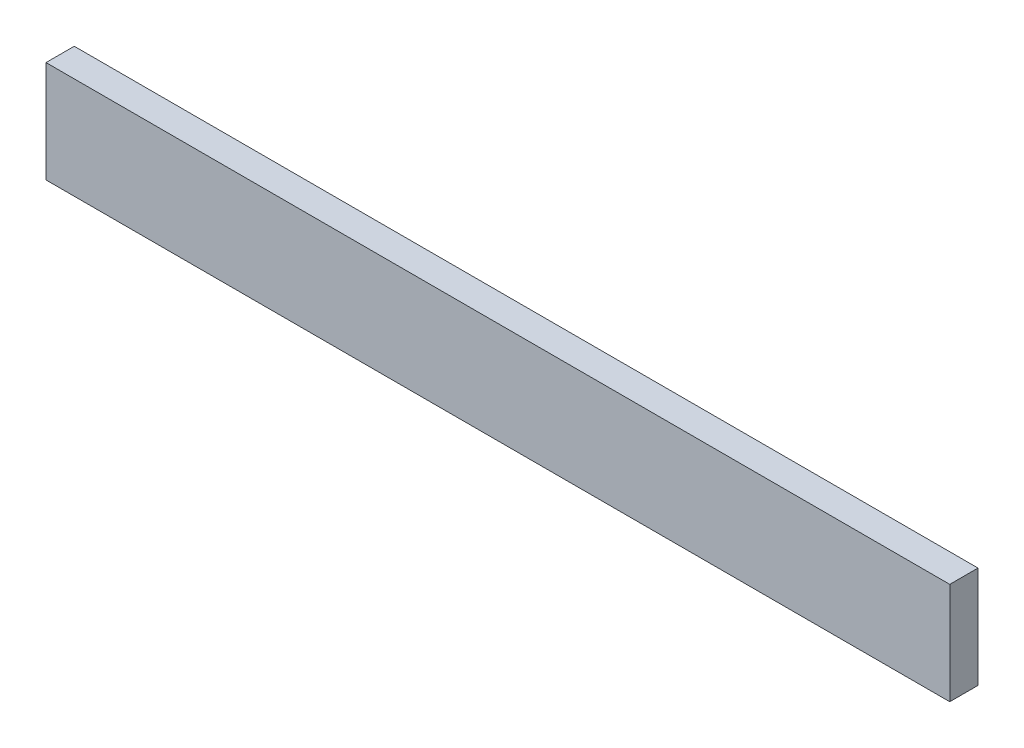
ISO-10303-21;
HEADER;
FILE_DESCRIPTION(('STEP AP214'),'2;1');
FILE_NAME('part.step','',(''),(''),'','','');
FILE_SCHEMA(('AUTOMOTIVE_DESIGN { 1 0 10303 214 1 1 1 1 }'));
ENDSEC;
DATA;
#1=APPLICATION_CONTEXT('core data for automotive mechanical design processes');
#2=APPLICATION_PROTOCOL_DEFINITION('international standard','automotive_design',2000,#1);
#3=PRODUCT_CONTEXT('',#1,'mechanical');
#4=PRODUCT('Part','Part','',(#3));
#5=PRODUCT_RELATED_PRODUCT_CATEGORY('part','',(#4));
#6=PRODUCT_DEFINITION_FORMATION('','',#4);
#7=PRODUCT_DEFINITION_CONTEXT('part definition',#1,'design');
#8=PRODUCT_DEFINITION('design','',#6,#7);
#9=PRODUCT_DEFINITION_SHAPE('','',#8);
#10=(LENGTH_UNIT() NAMED_UNIT(*) SI_UNIT(.MILLI.,.METRE.));
#11=(NAMED_UNIT(*) PLANE_ANGLE_UNIT() SI_UNIT($,.RADIAN.));
#12=(NAMED_UNIT(*) SI_UNIT($,.STERADIAN.) SOLID_ANGLE_UNIT());
#13=UNCERTAINTY_MEASURE_WITH_UNIT(LENGTH_MEASURE(1.E-05),#10,'distance_accuracy_value','');
#14=(GEOMETRIC_REPRESENTATION_CONTEXT(3) GLOBAL_UNCERTAINTY_ASSIGNED_CONTEXT((#13)) GLOBAL_UNIT_ASSIGNED_CONTEXT((#10,
#11,#12)) REPRESENTATION_CONTEXT('',''));
#15=CARTESIAN_POINT('',(0.,0.,0.));
#16=DIRECTION('',(0.,0.,1.));
#17=DIRECTION('',(1.,0.,0.));
#18=AXIS2_PLACEMENT_3D('',#15,#16,#17);
#19=CARTESIAN_POINT('',(0.,0.,25.));
#20=DIRECTION('',(1.,0.,0.));
#21=DIRECTION('',(0.,0.,-1.));
#22=AXIS2_PLACEMENT_3D('',#19,#20,#21);
#23=PLANE('',#22);
#24=DIRECTION('',(0.,-1.,0.));
#25=VECTOR('',#24,1.);
#26=CARTESIAN_POINT('',(0.,0.,0.));
#27=LINE('',#26,#25);
#28=CARTESIAN_POINT('',(0.,90.,0.));
#29=VERTEX_POINT('',#28);
#30=CARTESIAN_POINT('',(0.,0.,0.));
#31=VERTEX_POINT('',#30);
#32=EDGE_CURVE('E111',#29,#31,#27,.T.);
#33=ORIENTED_EDGE('',*,*,#32,.T.);
#34=DIRECTION('',(0.,0.,-1.));
#35=VECTOR('',#34,1.);
#36=CARTESIAN_POINT('',(0.,0.,25.));
#37=LINE('',#36,#35);
#38=CARTESIAN_POINT('',(0.,0.,25.));
#39=VERTEX_POINT('',#38);
#40=EDGE_CURVE('E11',#39,#31,#37,.T.);
#41=ORIENTED_EDGE('',*,*,#40,.F.);
#42=DIRECTION('',(0.,-1.,0.));
#43=VECTOR('',#42,1.);
#44=CARTESIAN_POINT('',(0.,0.,25.));
#45=LINE('',#44,#43);
#46=CARTESIAN_POINT('',(0.,90.,25.));
#47=VERTEX_POINT('',#46);
#48=EDGE_CURVE('E95',#47,#39,#45,.T.);
#49=ORIENTED_EDGE('',*,*,#48,.F.);
#50=DIRECTION('',(0.,0.,-1.));
#51=VECTOR('',#50,1.);
#52=CARTESIAN_POINT('',(0.,90.,25.));
#53=LINE('',#52,#51);
#54=EDGE_CURVE('E107',#47,#29,#53,.T.);
#55=ORIENTED_EDGE('',*,*,#54,.T.);
#56=EDGE_LOOP('',(#33,#41,#49,#55));
#57=FACE_BOUND('',#56,.T.);
#58=ADVANCED_FACE('F43',(#57),#23,.F.);
#59=CARTESIAN_POINT('',(0.,0.,25.));
#60=DIRECTION('',(0.,1.,0.));
#61=DIRECTION('',(0.,0.,1.));
#62=AXIS2_PLACEMENT_3D('',#59,#60,#61);
#63=PLANE('',#62);
#64=DIRECTION('',(1.,0.,0.));
#65=VECTOR('',#64,1.);
#66=CARTESIAN_POINT('',(0.,0.,0.));
#67=LINE('',#66,#65);
#68=CARTESIAN_POINT('',(800.,0.,0.));
#69=VERTEX_POINT('',#68);
#70=EDGE_CURVE('E100',#31,#69,#67,.T.);
#71=ORIENTED_EDGE('',*,*,#70,.T.);
#72=DIRECTION('',(0.,0.,-1.));
#73=VECTOR('',#72,1.);
#74=CARTESIAN_POINT('',(800.,0.,25.));
#75=LINE('',#74,#73);
#76=CARTESIAN_POINT('',(800.,0.,25.));
#77=VERTEX_POINT('',#76);
#78=EDGE_CURVE('E52',#77,#69,#75,.T.);
#79=ORIENTED_EDGE('',*,*,#78,.F.);
#80=DIRECTION('',(1.,0.,0.));
#81=VECTOR('',#80,1.);
#82=CARTESIAN_POINT('',(0.,0.,25.));
#83=LINE('',#82,#81);
#84=EDGE_CURVE('E90',#39,#77,#83,.T.);
#85=ORIENTED_EDGE('',*,*,#84,.F.);
#86=ORIENTED_EDGE('',*,*,#40,.T.);
#87=EDGE_LOOP('',(#71,#79,#85,#86));
#88=FACE_BOUND('',#87,.T.);
#89=ADVANCED_FACE('F99',(#88),#63,.F.);
#90=CARTESIAN_POINT('',(800.,0.,25.));
#91=DIRECTION('',(-1.,0.,0.));
#92=DIRECTION('',(0.,0.,1.));
#93=AXIS2_PLACEMENT_3D('',#90,#91,#92);
#94=PLANE('',#93);
#95=DIRECTION('',(0.,1.,0.));
#96=VECTOR('',#95,1.);
#97=CARTESIAN_POINT('',(800.,0.,0.));
#98=LINE('',#97,#96);
#99=CARTESIAN_POINT('',(800.,90.,0.));
#100=VERTEX_POINT('',#99);
#101=EDGE_CURVE('E77',#69,#100,#98,.T.);
#102=ORIENTED_EDGE('',*,*,#101,.T.);
#103=DIRECTION('',(0.,0.,-1.));
#104=VECTOR('',#103,1.);
#105=CARTESIAN_POINT('',(800.,90.,25.));
#106=LINE('',#105,#104);
#107=CARTESIAN_POINT('',(800.,90.,25.));
#108=VERTEX_POINT('',#107);
#109=EDGE_CURVE('E102',#108,#100,#106,.T.);
#110=ORIENTED_EDGE('',*,*,#109,.F.);
#111=DIRECTION('',(0.,1.,0.));
#112=VECTOR('',#111,1.);
#113=CARTESIAN_POINT('',(800.,0.,25.));
#114=LINE('',#113,#112);
#115=EDGE_CURVE('E93',#77,#108,#114,.T.);
#116=ORIENTED_EDGE('',*,*,#115,.F.);
#117=ORIENTED_EDGE('',*,*,#78,.T.);
#118=EDGE_LOOP('',(#102,#110,#116,#117));
#119=FACE_BOUND('',#118,.T.);
#120=ADVANCED_FACE('F103',(#119),#94,.F.);
#121=CARTESIAN_POINT('',(0.,90.,25.));
#122=DIRECTION('',(0.,-1.,0.));
#123=DIRECTION('',(0.,0.,-1.));
#124=AXIS2_PLACEMENT_3D('',#121,#122,#123);
#125=PLANE('',#124);
#126=DIRECTION('',(-1.,0.,0.));
#127=VECTOR('',#126,1.);
#128=CARTESIAN_POINT('',(0.,90.,0.));
#129=LINE('',#128,#127);
#130=EDGE_CURVE('E83',#100,#29,#129,.T.);
#131=ORIENTED_EDGE('',*,*,#130,.T.);
#132=ORIENTED_EDGE('',*,*,#54,.F.);
#133=DIRECTION('',(-1.,0.,0.));
#134=VECTOR('',#133,1.);
#135=CARTESIAN_POINT('',(0.,90.,25.));
#136=LINE('',#135,#134);
#137=EDGE_CURVE('E60',#108,#47,#136,.T.);
#138=ORIENTED_EDGE('',*,*,#137,.F.);
#139=ORIENTED_EDGE('',*,*,#109,.T.);
#140=EDGE_LOOP('',(#131,#132,#138,#139));
#141=FACE_BOUND('',#140,.T.);
#142=ADVANCED_FACE('F124',(#141),#125,.F.);
#143=CARTESIAN_POINT('',(0.,0.,25.));
#144=DIRECTION('',(0.,0.,-1.));
#145=DIRECTION('',(-1.,0.,0.));
#146=AXIS2_PLACEMENT_3D('',#143,#144,#145);
#147=PLANE('',#146);
#148=ORIENTED_EDGE('',*,*,#48,.T.);
#149=ORIENTED_EDGE('',*,*,#84,.T.);
#150=ORIENTED_EDGE('',*,*,#115,.T.);
#151=ORIENTED_EDGE('',*,*,#137,.T.);
#152=EDGE_LOOP('',(#148,#149,#150,#151));
#153=FACE_BOUND('',#152,.T.);
#154=ADVANCED_FACE('F91',(#153),#147,.F.);
#155=CARTESIAN_POINT('',(0.,0.,0.));
#156=DIRECTION('',(0.,0.,-1.));
#157=DIRECTION('',(-1.,0.,0.));
#158=AXIS2_PLACEMENT_3D('',#155,#156,#157);
#159=PLANE('',#158);
#160=ORIENTED_EDGE('',*,*,#32,.F.);
#161=ORIENTED_EDGE('',*,*,#130,.F.);
#162=ORIENTED_EDGE('',*,*,#101,.F.);
#163=ORIENTED_EDGE('',*,*,#70,.F.);
#164=EDGE_LOOP('',(#160,#161,#162,#163));
#165=FACE_BOUND('',#164,.T.);
#166=ADVANCED_FACE('F127',(#165),#159,.T.);
#167=CLOSED_SHELL('',(#58,#89,#120,#142,#154,#166));
#168=MANIFOLD_SOLID_BREP('B2',#167);
#169=ADVANCED_BREP_SHAPE_REPRESENTATION('',(#18,#168),#14);
#170=SHAPE_DEFINITION_REPRESENTATION(#9,#169);
ENDSEC;
END-ISO-10303-21;
